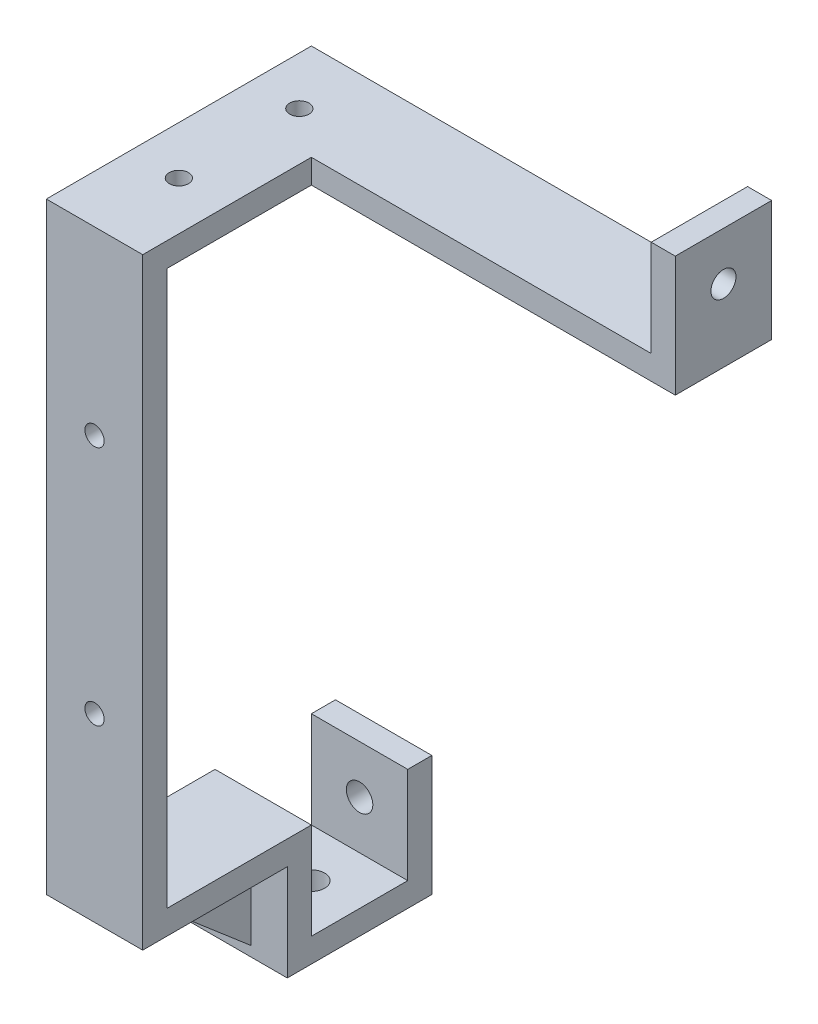
ISO-10303-21;
HEADER;
FILE_DESCRIPTION(('STEP AP214'),'2;1');
FILE_NAME('part.step','',(''),(''),'','','');
FILE_SCHEMA(('AUTOMOTIVE_DESIGN { 1 0 10303 214 1 1 1 1 }'));
ENDSEC;
DATA;
#1=APPLICATION_CONTEXT('core data for automotive mechanical design processes');
#2=APPLICATION_PROTOCOL_DEFINITION('international standard','automotive_design',2000,#1);
#3=PRODUCT_CONTEXT('',#1,'mechanical');
#4=PRODUCT('Part','Part','',(#3));
#5=PRODUCT_RELATED_PRODUCT_CATEGORY('part','',(#4));
#6=PRODUCT_DEFINITION_FORMATION('','',#4);
#7=PRODUCT_DEFINITION_CONTEXT('part definition',#1,'design');
#8=PRODUCT_DEFINITION('design','',#6,#7);
#9=PRODUCT_DEFINITION_SHAPE('','',#8);
#10=(LENGTH_UNIT() NAMED_UNIT(*) SI_UNIT(.MILLI.,.METRE.));
#11=(NAMED_UNIT(*) PLANE_ANGLE_UNIT() SI_UNIT($,.RADIAN.));
#12=(NAMED_UNIT(*) SI_UNIT($,.STERADIAN.) SOLID_ANGLE_UNIT());
#13=UNCERTAINTY_MEASURE_WITH_UNIT(LENGTH_MEASURE(1.E-05),#10,'distance_accuracy_value','');
#14=(GEOMETRIC_REPRESENTATION_CONTEXT(3) GLOBAL_UNCERTAINTY_ASSIGNED_CONTEXT((#13)) GLOBAL_UNIT_ASSIGNED_CONTEXT((#10,
#11,#12)) REPRESENTATION_CONTEXT('',''));
#15=CARTESIAN_POINT('',(0.,0.,0.));
#16=DIRECTION('',(0.,0.,1.));
#17=DIRECTION('',(1.,0.,0.));
#18=AXIS2_PLACEMENT_3D('',#15,#16,#17);
#19=CARTESIAN_POINT('',(-9.82905982905984,-125.128205128205,-55.));
#20=DIRECTION('',(0.,-1.,0.));
#21=DIRECTION('',(0.,0.,-1.));
#22=AXIS2_PLACEMENT_3D('',#19,#20,#21);
#23=PLANE('',#22);
#24=CARTESIAN_POINT('',(0.170940170940168,-125.128205128205,-45.));
#25=DIRECTION('',(0.,1.,0.));
#26=DIRECTION('',(0.,0.,1.));
#27=AXIS2_PLACEMENT_3D('',#24,#25,#26);
#28=CIRCLE('',#27,2.75);
#29=CARTESIAN_POINT('',(0.170940170940168,-125.128205128205,-42.25));
#30=VERTEX_POINT('',#29);
#31=EDGE_CURVE('E277',#30,#30,#28,.T.);
#32=ORIENTED_EDGE('',*,*,#31,.F.);
#33=EDGE_LOOP('',(#32));
#34=FACE_BOUND('',#33,.T.);
#35=DIRECTION('',(1.,0.,0.));
#36=VECTOR('',#35,1.);
#37=CARTESIAN_POINT('',(10.1709401709402,-125.128205128205,-55.));
#38=LINE('',#37,#36);
#39=CARTESIAN_POINT('',(-9.82905982905984,-125.128205128205,-55.));
#40=VERTEX_POINT('',#39);
#41=CARTESIAN_POINT('',(10.1709401709402,-125.128205128205,-55.));
#42=VERTEX_POINT('',#41);
#43=EDGE_CURVE('E242',#40,#42,#38,.T.);
#44=ORIENTED_EDGE('',*,*,#43,.F.);
#45=DIRECTION('',(0.,0.,1.));
#46=VECTOR('',#45,1.);
#47=CARTESIAN_POINT('',(-9.82905982905984,-125.128205128205,-55.));
#48=LINE('',#47,#46);
#49=CARTESIAN_POINT('',(-9.82905982905984,-125.128205128205,-35.));
#50=VERTEX_POINT('',#49);
#51=EDGE_CURVE('E342',#40,#50,#48,.T.);
#52=ORIENTED_EDGE('',*,*,#51,.T.);
#53=DIRECTION('',(1.,0.,0.));
#54=VECTOR('',#53,1.);
#55=CARTESIAN_POINT('',(-9.82905982905984,-125.128205128205,-35.));
#56=LINE('',#55,#54);
#57=CARTESIAN_POINT('',(10.1709401709402,-125.128205128205,-35.));
#58=VERTEX_POINT('',#57);
#59=EDGE_CURVE('E335',#50,#58,#56,.T.);
#60=ORIENTED_EDGE('',*,*,#59,.T.);
#61=DIRECTION('',(0.,0.,1.));
#62=VECTOR('',#61,1.);
#63=CARTESIAN_POINT('',(10.1709401709402,-125.128205128205,-55.));
#64=LINE('',#63,#62);
#65=EDGE_CURVE('E339',#42,#58,#64,.T.);
#66=ORIENTED_EDGE('',*,*,#65,.F.);
#67=EDGE_LOOP('',(#44,#52,#60,#66));
#68=FACE_BOUND('',#67,.T.);
#69=ADVANCED_FACE('F39',(#34,#68),#23,.F.);
#70=CARTESIAN_POINT('',(10.1709401709402,-110.128205128205,-35.));
#71=DIRECTION('',(0.,1.,0.));
#72=DIRECTION('',(0.,0.,1.));
#73=AXIS2_PLACEMENT_3D('',#70,#71,#72);
#74=PLANE('',#73);
#75=DIRECTION('',(-1.,0.,0.));
#76=VECTOR('',#75,1.);
#77=CARTESIAN_POINT('',(10.1709401709402,-110.128205128205,-30.));
#78=LINE('',#77,#76);
#79=CARTESIAN_POINT('',(10.1709401709402,-110.128205128205,-30.));
#80=VERTEX_POINT('',#79);
#81=CARTESIAN_POINT('',(-9.82905982905984,-110.128205128205,-30.));
#82=VERTEX_POINT('',#81);
#83=EDGE_CURVE('E345',#80,#82,#78,.T.);
#84=ORIENTED_EDGE('',*,*,#83,.F.);
#85=DIRECTION('',(0.,0.,1.));
#86=VECTOR('',#85,1.);
#87=CARTESIAN_POINT('',(10.1709401709402,-110.128205128205,-35.));
#88=LINE('',#87,#86);
#89=CARTESIAN_POINT('',(10.1709401709402,-110.128205128205,0.));
#90=VERTEX_POINT('',#89);
#91=EDGE_CURVE('E390',#80,#90,#88,.T.);
#92=ORIENTED_EDGE('',*,*,#91,.T.);
#93=DIRECTION('',(-1.,0.,0.));
#94=VECTOR('',#93,1.);
#95=CARTESIAN_POINT('',(0.,-110.128205128205,0.));
#96=LINE('',#95,#94);
#97=CARTESIAN_POINT('',(-9.82905982905984,-110.128205128205,0.));
#98=VERTEX_POINT('',#97);
#99=EDGE_CURVE('E436',#90,#98,#96,.T.);
#100=ORIENTED_EDGE('',*,*,#99,.T.);
#101=DIRECTION('',(0.,0.,1.));
#102=VECTOR('',#101,1.);
#103=CARTESIAN_POINT('',(-9.82905982905984,-110.128205128205,-35.));
#104=LINE('',#103,#102);
#105=EDGE_CURVE('E387',#82,#98,#104,.T.);
#106=ORIENTED_EDGE('',*,*,#105,.F.);
#107=EDGE_LOOP('',(#84,#92,#100,#106));
#108=FACE_BOUND('',#107,.T.);
#109=DIRECTION('',(0.,0.,1.));
#110=VECTOR('',#109,1.);
#111=CARTESIAN_POINT('',(2.67094017094017,-110.128205128205,-35.));
#112=LINE('',#111,#110);
#113=CARTESIAN_POINT('',(2.67094017094017,-110.128205128205,-29.9291696383079));
#114=VERTEX_POINT('',#113);
#115=CARTESIAN_POINT('',(2.67094017094017,-110.128205128205,-9.07177753676453));
#116=VERTEX_POINT('',#115);
#117=EDGE_CURVE('E11',#114,#116,#112,.T.);
#118=ORIENTED_EDGE('',*,*,#117,.F.);
#119=DIRECTION('',(1.,0.,0.));
#120=VECTOR('',#119,1.);
#121=CARTESIAN_POINT('',(10.1709401709402,-110.128205128205,-29.9291696383079));
#122=LINE('',#121,#120);
#123=CARTESIAN_POINT('',(-2.32905982905983,-110.128205128205,-29.9291696383079));
#124=VERTEX_POINT('',#123);
#125=EDGE_CURVE('E446',#124,#114,#122,.T.);
#126=ORIENTED_EDGE('',*,*,#125,.F.);
#127=DIRECTION('',(0.,0.,1.));
#128=VECTOR('',#127,1.);
#129=CARTESIAN_POINT('',(-2.32905982905983,-110.128205128205,-35.));
#130=LINE('',#129,#128);
#131=CARTESIAN_POINT('',(-2.32905982905983,-110.128205128205,-9.07177753676453));
#132=VERTEX_POINT('',#131);
#133=EDGE_CURVE('E442',#124,#132,#130,.T.);
#134=ORIENTED_EDGE('',*,*,#133,.T.);
#135=DIRECTION('',(-1.,0.,0.));
#136=VECTOR('',#135,1.);
#137=CARTESIAN_POINT('',(10.1709401709402,-110.128205128205,-9.07177753676454));
#138=LINE('',#137,#136);
#139=EDGE_CURVE('E48',#116,#132,#138,.T.);
#140=ORIENTED_EDGE('',*,*,#139,.F.);
#141=EDGE_LOOP('',(#118,#126,#134,#140));
#142=FACE_BOUND('',#141,.T.);
#143=ADVANCED_FACE('F458',(#108,#142),#74,.F.);
#144=CARTESIAN_POINT('',(0.,0.,-35.));
#145=DIRECTION('',(0.,0.,-1.));
#146=DIRECTION('',(-1.,0.,0.));
#147=AXIS2_PLACEMENT_3D('',#144,#145,#146);
#148=PLANE('',#147);
#149=DIRECTION('',(0.,-1.,0.));
#150=VECTOR('',#149,1.);
#151=CARTESIAN_POINT('',(10.1709401709402,-105.128205128205,-35.));
#152=LINE('',#151,#150);
#153=CARTESIAN_POINT('',(10.1709401709402,-105.128205128205,-35.));
#154=VERTEX_POINT('',#153);
#155=EDGE_CURVE('E368',#154,#58,#152,.T.);
#156=ORIENTED_EDGE('',*,*,#155,.T.);
#157=ORIENTED_EDGE('',*,*,#59,.F.);
#158=DIRECTION('',(0.,1.,0.));
#159=VECTOR('',#158,1.);
#160=CARTESIAN_POINT('',(-9.82905982905984,-110.128205128205,-35.));
#161=LINE('',#160,#159);
#162=CARTESIAN_POINT('',(-9.82905982905984,-105.128205128205,-35.));
#163=VERTEX_POINT('',#162);
#164=EDGE_CURVE('E372',#50,#163,#161,.T.);
#165=ORIENTED_EDGE('',*,*,#164,.T.);
#166=DIRECTION('',(1.,0.,0.));
#167=VECTOR('',#166,1.);
#168=CARTESIAN_POINT('',(10.1709401709402,-105.128205128205,-35.));
#169=LINE('',#168,#167);
#170=EDGE_CURVE('E375',#163,#154,#169,.T.);
#171=ORIENTED_EDGE('',*,*,#170,.T.);
#172=EDGE_LOOP('',(#156,#157,#165,#171));
#173=FACE_BOUND('',#172,.T.);
#174=ADVANCED_FACE('F483',(#173),#148,.T.);
#175=CARTESIAN_POINT('',(0.,0.,-5.));
#176=DIRECTION('',(0.,0.,1.));
#177=DIRECTION('',(1.,0.,0.));
#178=AXIS2_PLACEMENT_3D('',#175,#176,#177);
#179=PLANE('',#178);
#180=CARTESIAN_POINT('',(0.170940170940166,-22.6282051282051,-5.));
#181=DIRECTION('',(0.,0.,-1.));
#182=DIRECTION('',(-1.,0.,0.));
#183=AXIS2_PLACEMENT_3D('',#180,#181,#182);
#184=CIRCLE('',#183,2.);
#185=CARTESIAN_POINT('',(-1.82905982905983,-22.6282051282051,-5.));
#186=VERTEX_POINT('',#185);
#187=EDGE_CURVE('E291',#186,#186,#184,.T.);
#188=ORIENTED_EDGE('',*,*,#187,.F.);
#189=EDGE_LOOP('',(#188));
#190=FACE_BOUND('',#189,.T.);
#191=CARTESIAN_POINT('',(0.170940170940166,-72.6282051282051,-5.));
#192=DIRECTION('',(0.,0.,-1.));
#193=DIRECTION('',(-1.,0.,0.));
#194=AXIS2_PLACEMENT_3D('',#191,#192,#193);
#195=CIRCLE('',#194,2.);
#196=CARTESIAN_POINT('',(-1.82905982905983,-72.6282051282051,-5.));
#197=VERTEX_POINT('',#196);
#198=EDGE_CURVE('E282',#197,#197,#195,.T.);
#199=ORIENTED_EDGE('',*,*,#198,.F.);
#200=EDGE_LOOP('',(#199));
#201=FACE_BOUND('',#200,.T.);
#202=DIRECTION('',(1.,0.,0.));
#203=VECTOR('',#202,1.);
#204=CARTESIAN_POINT('',(10.1709401709402,-105.128205128205,-5.));
#205=LINE('',#204,#203);
#206=CARTESIAN_POINT('',(-9.82905982905984,-105.128205128205,-5.));
#207=VERTEX_POINT('',#206);
#208=CARTESIAN_POINT('',(10.1709401709402,-105.128205128205,-5.));
#209=VERTEX_POINT('',#208);
#210=EDGE_CURVE('E367',#207,#209,#205,.T.);
#211=ORIENTED_EDGE('',*,*,#210,.F.);
#212=DIRECTION('',(0.,-1.,0.));
#213=VECTOR('',#212,1.);
#214=CARTESIAN_POINT('',(-9.82905982905984,14.8717948717949,-5.));
#215=LINE('',#214,#213);
#216=CARTESIAN_POINT('',(-9.82905982905984,9.87179487179487,-5.));
#217=VERTEX_POINT('',#216);
#218=EDGE_CURVE('E413',#217,#207,#215,.T.);
#219=ORIENTED_EDGE('',*,*,#218,.F.);
#220=DIRECTION('',(-1.,0.,0.));
#221=VECTOR('',#220,1.);
#222=CARTESIAN_POINT('',(10.1709401709402,9.87179487179488,-5.));
#223=LINE('',#222,#221);
#224=CARTESIAN_POINT('',(10.1709401709402,9.87179487179487,-5.));
#225=VERTEX_POINT('',#224);
#226=EDGE_CURVE('E393',#225,#217,#223,.T.);
#227=ORIENTED_EDGE('',*,*,#226,.F.);
#228=DIRECTION('',(0.,1.,0.));
#229=VECTOR('',#228,1.);
#230=CARTESIAN_POINT('',(10.1709401709402,14.8717948717949,-5.));
#231=LINE('',#230,#229);
#232=EDGE_CURVE('E417',#209,#225,#231,.T.);
#233=ORIENTED_EDGE('',*,*,#232,.F.);
#234=EDGE_LOOP('',(#211,#219,#227,#233));
#235=FACE_BOUND('',#234,.T.);
#236=ADVANCED_FACE('F501',(#190,#201,#235),#179,.F.);
#237=CARTESIAN_POINT('',(-9.82905982905984,14.8717948717949,-5.));
#238=DIRECTION('',(-1.,0.,0.));
#239=DIRECTION('',(0.,-1.,0.));
#240=AXIS2_PLACEMENT_3D('',#237,#238,#239);
#241=PLANE('',#240);
#242=ORIENTED_EDGE('',*,*,#164,.F.);
#243=ORIENTED_EDGE('',*,*,#51,.F.);
#244=DIRECTION('',(0.,-1.,0.));
#245=VECTOR('',#244,1.);
#246=CARTESIAN_POINT('',(-9.82905982905984,-105.128205128205,-55.));
#247=LINE('',#246,#245);
#248=CARTESIAN_POINT('',(-9.82905982905984,-105.128205128205,-55.));
#249=VERTEX_POINT('',#248);
#250=EDGE_CURVE('E263',#249,#40,#247,.T.);
#251=ORIENTED_EDGE('',*,*,#250,.F.);
#252=DIRECTION('',(0.,0.,1.));
#253=VECTOR('',#252,1.);
#254=CARTESIAN_POINT('',(-9.82905982905984,-105.128205128205,-60.));
#255=LINE('',#254,#253);
#256=CARTESIAN_POINT('',(-9.82905982905984,-105.128205128205,-60.));
#257=VERTEX_POINT('',#256);
#258=EDGE_CURVE('E251',#257,#249,#255,.T.);
#259=ORIENTED_EDGE('',*,*,#258,.F.);
#260=DIRECTION('',(0.,1.,0.));
#261=VECTOR('',#260,1.);
#262=CARTESIAN_POINT('',(-9.82905982905984,-130.128205128205,-60.));
#263=LINE('',#262,#261);
#264=CARTESIAN_POINT('',(-9.82905982905984,-130.128205128205,-60.));
#265=VERTEX_POINT('',#264);
#266=EDGE_CURVE('E270',#265,#257,#263,.T.);
#267=ORIENTED_EDGE('',*,*,#266,.F.);
#268=DIRECTION('',(0.,0.,-1.));
#269=VECTOR('',#268,1.);
#270=CARTESIAN_POINT('',(-9.82905982905984,-130.128205128205,-35.));
#271=LINE('',#270,#269);
#272=CARTESIAN_POINT('',(-9.82905982905984,-130.128205128205,-30.));
#273=VERTEX_POINT('',#272);
#274=EDGE_CURVE('E353',#273,#265,#271,.T.);
#275=ORIENTED_EDGE('',*,*,#274,.F.);
#276=DIRECTION('',(0.,1.,0.));
#277=VECTOR('',#276,1.);
#278=CARTESIAN_POINT('',(-9.82905982905984,-130.128205128205,-30.));
#279=LINE('',#278,#277);
#280=EDGE_CURVE('E356',#273,#82,#279,.T.);
#281=ORIENTED_EDGE('',*,*,#280,.T.);
#282=ORIENTED_EDGE('',*,*,#105,.T.);
#283=DIRECTION('',(0.,-1.,0.));
#284=VECTOR('',#283,1.);
#285=CARTESIAN_POINT('',(-9.82905982905984,14.8717948717949,0.));
#286=LINE('',#285,#284);
#287=CARTESIAN_POINT('',(-9.82905982905984,14.8717948717949,0.));
#288=VERTEX_POINT('',#287);
#289=EDGE_CURVE('E412',#288,#98,#286,.T.);
#290=ORIENTED_EDGE('',*,*,#289,.F.);
#291=DIRECTION('',(0.,0.,1.));
#292=VECTOR('',#291,1.);
#293=CARTESIAN_POINT('',(-9.82905982905984,14.8717948717949,-5.));
#294=LINE('',#293,#292);
#295=CARTESIAN_POINT('',(-9.82905982905984,14.8717948717949,-55.));
#296=VERTEX_POINT('',#295);
#297=EDGE_CURVE('E433',#296,#288,#294,.T.);
#298=ORIENTED_EDGE('',*,*,#297,.F.);
#299=DIRECTION('',(0.,1.,0.));
#300=VECTOR('',#299,1.);
#301=CARTESIAN_POINT('',(-9.82905982905984,14.8717948717949,-55.));
#302=LINE('',#301,#300);
#303=CARTESIAN_POINT('',(-9.82905982905984,9.87179487179487,-55.));
#304=VERTEX_POINT('',#303);
#305=EDGE_CURVE('E397',#304,#296,#302,.T.);
#306=ORIENTED_EDGE('',*,*,#305,.F.);
#307=DIRECTION('',(0.,0.,1.));
#308=VECTOR('',#307,1.);
#309=CARTESIAN_POINT('',(-9.82905982905984,9.87179487179487,-55.));
#310=LINE('',#309,#308);
#311=EDGE_CURVE('E402',#304,#217,#310,.T.);
#312=ORIENTED_EDGE('',*,*,#311,.T.);
#313=ORIENTED_EDGE('',*,*,#218,.T.);
#314=DIRECTION('',(0.,0.,1.));
#315=VECTOR('',#314,1.);
#316=CARTESIAN_POINT('',(-9.82905982905984,-105.128205128205,-35.));
#317=LINE('',#316,#315);
#318=EDGE_CURVE('E384',#163,#207,#317,.T.);
#319=ORIENTED_EDGE('',*,*,#318,.F.);
#320=EDGE_LOOP('',(#242,#243,#251,#259,#267,#275,#281,#282,#290,#298,#306,#312,#313,#319));
#321=FACE_BOUND('',#320,.T.);
#322=ADVANCED_FACE('F41',(#321),#241,.T.);
#323=CARTESIAN_POINT('',(-9.82905982905984,14.8717948717949,-5.));
#324=DIRECTION('',(0.,1.,0.));
#325=DIRECTION('',(0.,0.,1.));
#326=AXIS2_PLACEMENT_3D('',#323,#324,#325);
#327=PLANE('',#326);
#328=DIRECTION('',(0.,0.,1.));
#329=VECTOR('',#328,1.);
#330=CARTESIAN_POINT('',(80.6909401709401,14.8717948717949,-55.));
#331=LINE('',#330,#329);
#332=CARTESIAN_POINT('',(80.6909401709401,14.8717948717949,-55.));
#333=VERTEX_POINT('',#332);
#334=CARTESIAN_POINT('',(80.6909401709401,14.8717948717949,-35.));
#335=VERTEX_POINT('',#334);
#336=EDGE_CURVE('E55',#333,#335,#331,.T.);
#337=ORIENTED_EDGE('',*,*,#336,.F.);
#338=DIRECTION('',(1.,0.,0.));
#339=VECTOR('',#338,1.);
#340=CARTESIAN_POINT('',(10.1709401709402,14.8717948717949,-55.));
#341=LINE('',#340,#339);
#342=EDGE_CURVE('E208',#296,#333,#341,.T.);
#343=ORIENTED_EDGE('',*,*,#342,.F.);
#344=ORIENTED_EDGE('',*,*,#297,.T.);
#345=DIRECTION('',(-1.,0.,0.));
#346=VECTOR('',#345,1.);
#347=CARTESIAN_POINT('',(-9.82905982905984,14.8717948717949,0.));
#348=LINE('',#347,#346);
#349=CARTESIAN_POINT('',(10.1709401709402,14.8717948717949,0.));
#350=VERTEX_POINT('',#349);
#351=EDGE_CURVE('E418',#350,#288,#348,.T.);
#352=ORIENTED_EDGE('',*,*,#351,.F.);
#353=DIRECTION('',(0.,0.,1.));
#354=VECTOR('',#353,1.);
#355=CARTESIAN_POINT('',(10.1709401709402,14.8717948717949,-5.));
#356=LINE('',#355,#354);
#357=CARTESIAN_POINT('',(10.1709401709402,14.8717948717949,-35.));
#358=VERTEX_POINT('',#357);
#359=EDGE_CURVE('E422',#358,#350,#356,.T.);
#360=ORIENTED_EDGE('',*,*,#359,.F.);
#361=DIRECTION('',(-1.,0.,0.));
#362=VECTOR('',#361,1.);
#363=CARTESIAN_POINT('',(85.6909401709401,14.8717948717949,-35.));
#364=LINE('',#363,#362);
#365=EDGE_CURVE('E62',#335,#358,#364,.T.);
#366=ORIENTED_EDGE('',*,*,#365,.F.);
#367=EDGE_LOOP('',(#337,#343,#344,#352,#360,#366));
#368=FACE_BOUND('',#367,.T.);
#369=CARTESIAN_POINT('',(0.170940170940157,14.8717948717949,-17.5));
#370=DIRECTION('',(0.,-1.,0.));
#371=DIRECTION('',(1.,0.,0.));
#372=AXIS2_PLACEMENT_3D('',#369,#370,#371);
#373=CIRCLE('',#372,2.);
#374=CARTESIAN_POINT('',(2.17094017094016,14.8717948717949,-17.5));
#375=VERTEX_POINT('',#374);
#376=EDGE_CURVE('E302',#375,#375,#373,.T.);
#377=ORIENTED_EDGE('',*,*,#376,.T.);
#378=EDGE_LOOP('',(#377));
#379=FACE_BOUND('',#378,.T.);
#380=CARTESIAN_POINT('',(0.170940170940164,14.8717948717949,-42.5));
#381=DIRECTION('',(0.,-1.,0.));
#382=DIRECTION('',(1.,0.,0.));
#383=AXIS2_PLACEMENT_3D('',#380,#381,#382);
#384=CIRCLE('',#383,2.);
#385=CARTESIAN_POINT('',(2.17094017094016,14.8717948717949,-42.5));
#386=VERTEX_POINT('',#385);
#387=EDGE_CURVE('E311',#386,#386,#384,.T.);
#388=ORIENTED_EDGE('',*,*,#387,.T.);
#389=EDGE_LOOP('',(#388));
#390=FACE_BOUND('',#389,.T.);
#391=ADVANCED_FACE('F520',(#368,#379,#390),#327,.T.);
#392=CARTESIAN_POINT('',(10.1709401709402,14.8717948717949,-5.));
#393=DIRECTION('',(1.,0.,0.));
#394=DIRECTION('',(0.,1.,0.));
#395=AXIS2_PLACEMENT_3D('',#392,#393,#394);
#396=PLANE('',#395);
#397=DIRECTION('',(0.,-1.,0.));
#398=VECTOR('',#397,1.);
#399=CARTESIAN_POINT('',(10.1709401709402,14.8717948717949,-35.));
#400=LINE('',#399,#398);
#401=CARTESIAN_POINT('',(10.1709401709402,9.87179487179488,-35.));
#402=VERTEX_POINT('',#401);
#403=EDGE_CURVE('E210',#358,#402,#400,.T.);
#404=ORIENTED_EDGE('',*,*,#403,.F.);
#405=ORIENTED_EDGE('',*,*,#359,.T.);
#406=DIRECTION('',(0.,1.,0.));
#407=VECTOR('',#406,1.);
#408=CARTESIAN_POINT('',(10.1709401709402,14.8717948717949,0.));
#409=LINE('',#408,#407);
#410=EDGE_CURVE('E426',#90,#350,#409,.T.);
#411=ORIENTED_EDGE('',*,*,#410,.F.);
#412=ORIENTED_EDGE('',*,*,#91,.F.);
#413=DIRECTION('',(0.,1.,0.));
#414=VECTOR('',#413,1.);
#415=CARTESIAN_POINT('',(10.1709401709402,-130.128205128205,-30.));
#416=LINE('',#415,#414);
#417=CARTESIAN_POINT('',(10.1709401709402,-130.128205128205,-30.));
#418=VERTEX_POINT('',#417);
#419=EDGE_CURVE('E363',#418,#80,#416,.T.);
#420=ORIENTED_EDGE('',*,*,#419,.F.);
#421=DIRECTION('',(0.,0.,1.));
#422=VECTOR('',#421,1.);
#423=CARTESIAN_POINT('',(10.1709401709402,-130.128205128205,-30.));
#424=LINE('',#423,#422);
#425=CARTESIAN_POINT('',(10.1709401709402,-130.128205128205,-60.));
#426=VERTEX_POINT('',#425);
#427=EDGE_CURVE('E346',#426,#418,#424,.T.);
#428=ORIENTED_EDGE('',*,*,#427,.F.);
#429=DIRECTION('',(0.,-1.,0.));
#430=VECTOR('',#429,1.);
#431=CARTESIAN_POINT('',(10.1709401709402,-125.128205128205,-60.));
#432=LINE('',#431,#430);
#433=CARTESIAN_POINT('',(10.1709401709402,-105.128205128205,-60.));
#434=VERTEX_POINT('',#433);
#435=EDGE_CURVE('E273',#434,#426,#432,.T.);
#436=ORIENTED_EDGE('',*,*,#435,.F.);
#437=DIRECTION('',(0.,0.,-1.));
#438=VECTOR('',#437,1.);
#439=CARTESIAN_POINT('',(10.1709401709402,-105.128205128205,-55.));
#440=LINE('',#439,#438);
#441=CARTESIAN_POINT('',(10.1709401709402,-105.128205128205,-55.));
#442=VERTEX_POINT('',#441);
#443=EDGE_CURVE('E243',#442,#434,#440,.T.);
#444=ORIENTED_EDGE('',*,*,#443,.F.);
#445=DIRECTION('',(0.,-1.,0.));
#446=VECTOR('',#445,1.);
#447=CARTESIAN_POINT('',(10.1709401709402,-105.128205128205,-55.));
#448=LINE('',#447,#446);
#449=EDGE_CURVE('E257',#442,#42,#448,.T.);
#450=ORIENTED_EDGE('',*,*,#449,.T.);
#451=ORIENTED_EDGE('',*,*,#65,.T.);
#452=ORIENTED_EDGE('',*,*,#155,.F.);
#453=DIRECTION('',(0.,0.,1.));
#454=VECTOR('',#453,1.);
#455=CARTESIAN_POINT('',(10.1709401709402,-105.128205128205,-35.));
#456=LINE('',#455,#454);
#457=EDGE_CURVE('E378',#154,#209,#456,.T.);
#458=ORIENTED_EDGE('',*,*,#457,.T.);
#459=ORIENTED_EDGE('',*,*,#232,.T.);
#460=DIRECTION('',(0.,0.,1.));
#461=VECTOR('',#460,1.);
#462=CARTESIAN_POINT('',(10.1709401709402,9.87179487179488,-55.));
#463=LINE('',#462,#461);
#464=EDGE_CURVE('E409',#402,#225,#463,.T.);
#465=ORIENTED_EDGE('',*,*,#464,.F.);
#466=EDGE_LOOP('',(#404,#405,#411,#412,#420,#428,#436,#444,#450,#451,#452,#458,#459,#465));
#467=FACE_BOUND('',#466,.T.);
#468=ADVANCED_FACE('F518',(#467),#396,.T.);
#469=CARTESIAN_POINT('',(0.,0.,0.));
#470=DIRECTION('',(0.,0.,1.));
#471=DIRECTION('',(1.,0.,0.));
#472=AXIS2_PLACEMENT_3D('',#469,#470,#471);
#473=PLANE('',#472);
#474=CARTESIAN_POINT('',(0.170940170940166,-22.6282051282051,0.));
#475=DIRECTION('',(0.,0.,-1.));
#476=DIRECTION('',(-1.,0.,0.));
#477=AXIS2_PLACEMENT_3D('',#474,#475,#476);
#478=CIRCLE('',#477,2.);
#479=CARTESIAN_POINT('',(-1.82905982905983,-22.6282051282051,0.));
#480=VERTEX_POINT('',#479);
#481=EDGE_CURVE('E286',#480,#480,#478,.T.);
#482=ORIENTED_EDGE('',*,*,#481,.T.);
#483=EDGE_LOOP('',(#482));
#484=FACE_BOUND('',#483,.T.);
#485=CARTESIAN_POINT('',(0.170940170940166,-72.6282051282051,0.));
#486=DIRECTION('',(0.,0.,-1.));
#487=DIRECTION('',(-1.,0.,0.));
#488=AXIS2_PLACEMENT_3D('',#485,#486,#487);
#489=CIRCLE('',#488,2.);
#490=CARTESIAN_POINT('',(-1.82905982905983,-72.6282051282051,0.));
#491=VERTEX_POINT('',#490);
#492=EDGE_CURVE('E295',#491,#491,#489,.T.);
#493=ORIENTED_EDGE('',*,*,#492,.T.);
#494=EDGE_LOOP('',(#493));
#495=FACE_BOUND('',#494,.T.);
#496=ORIENTED_EDGE('',*,*,#99,.F.);
#497=ORIENTED_EDGE('',*,*,#410,.T.);
#498=ORIENTED_EDGE('',*,*,#351,.T.);
#499=ORIENTED_EDGE('',*,*,#289,.T.);
#500=EDGE_LOOP('',(#496,#497,#498,#499));
#501=FACE_BOUND('',#500,.T.);
#502=ADVANCED_FACE('F511',(#484,#495,#501),#473,.T.);
#503=CARTESIAN_POINT('',(10.1709401709402,9.87179487179488,-55.));
#504=DIRECTION('',(0.,1.,0.));
#505=DIRECTION('',(-1.,0.,0.));
#506=AXIS2_PLACEMENT_3D('',#503,#504,#505);
#507=PLANE('',#506);
#508=CARTESIAN_POINT('',(0.170940170940159,9.87179487179487,-17.5));
#509=DIRECTION('',(0.,-1.,0.));
#510=DIRECTION('',(1.,0.,0.));
#511=AXIS2_PLACEMENT_3D('',#508,#509,#510);
#512=CIRCLE('',#511,2.);
#513=CARTESIAN_POINT('',(2.17094017094016,9.87179487179487,-17.5));
#514=VERTEX_POINT('',#513);
#515=EDGE_CURVE('E307',#514,#514,#512,.T.);
#516=ORIENTED_EDGE('',*,*,#515,.F.);
#517=EDGE_LOOP('',(#516));
#518=FACE_BOUND('',#517,.T.);
#519=CARTESIAN_POINT('',(0.170940170940166,9.87179487179487,-42.5));
#520=DIRECTION('',(0.,-1.,0.));
#521=DIRECTION('',(1.,0.,0.));
#522=AXIS2_PLACEMENT_3D('',#519,#520,#521);
#523=CIRCLE('',#522,2.);
#524=CARTESIAN_POINT('',(2.17094017094017,9.87179487179487,-42.5));
#525=VERTEX_POINT('',#524);
#526=EDGE_CURVE('E290',#525,#525,#523,.T.);
#527=ORIENTED_EDGE('',*,*,#526,.F.);
#528=EDGE_LOOP('',(#527));
#529=FACE_BOUND('',#528,.T.);
#530=ORIENTED_EDGE('',*,*,#226,.T.);
#531=ORIENTED_EDGE('',*,*,#311,.F.);
#532=DIRECTION('',(-1.,0.,0.));
#533=VECTOR('',#532,1.);
#534=CARTESIAN_POINT('',(10.1709401709402,9.87179487179488,-55.));
#535=LINE('',#534,#533);
#536=CARTESIAN_POINT('',(85.6909401709401,9.87179487179488,-55.));
#537=VERTEX_POINT('',#536);
#538=EDGE_CURVE('E394',#537,#304,#535,.T.);
#539=ORIENTED_EDGE('',*,*,#538,.F.);
#540=DIRECTION('',(0.,0.,-1.));
#541=VECTOR('',#540,1.);
#542=CARTESIAN_POINT('',(85.6909401709401,9.87179487179488,-55.));
#543=LINE('',#542,#541);
#544=CARTESIAN_POINT('',(85.6909401709401,9.87179487179488,-35.));
#545=VERTEX_POINT('',#544);
#546=EDGE_CURVE('E221',#545,#537,#543,.T.);
#547=ORIENTED_EDGE('',*,*,#546,.F.);
#548=DIRECTION('',(-1.,0.,0.));
#549=VECTOR('',#548,1.);
#550=CARTESIAN_POINT('',(85.6909401709401,9.87179487179488,-35.));
#551=LINE('',#550,#549);
#552=EDGE_CURVE('E227',#545,#402,#551,.T.);
#553=ORIENTED_EDGE('',*,*,#552,.T.);
#554=ORIENTED_EDGE('',*,*,#464,.T.);
#555=EDGE_LOOP('',(#530,#531,#539,#547,#553,#554));
#556=FACE_BOUND('',#555,.T.);
#557=ADVANCED_FACE('F508',(#518,#529,#556),#507,.F.);
#558=CARTESIAN_POINT('',(0.,0.,-55.));
#559=DIRECTION('',(0.,0.,1.));
#560=DIRECTION('',(1.,0.,0.));
#561=AXIS2_PLACEMENT_3D('',#558,#559,#560);
#562=PLANE('',#561);
#563=ORIENTED_EDGE('',*,*,#342,.T.);
#564=DIRECTION('',(0.,-1.,0.));
#565=VECTOR('',#564,1.);
#566=CARTESIAN_POINT('',(80.6909401709401,34.8717948717949,-55.));
#567=LINE('',#566,#565);
#568=CARTESIAN_POINT('',(80.6909401709401,34.8717948717949,-55.));
#569=VERTEX_POINT('',#568);
#570=EDGE_CURVE('E188',#569,#333,#567,.T.);
#571=ORIENTED_EDGE('',*,*,#570,.F.);
#572=DIRECTION('',(-1.,0.,0.));
#573=VECTOR('',#572,1.);
#574=CARTESIAN_POINT('',(80.6909401709401,34.8717948717949,-55.));
#575=LINE('',#574,#573);
#576=CARTESIAN_POINT('',(85.6909401709401,34.8717948717949,-55.));
#577=VERTEX_POINT('',#576);
#578=EDGE_CURVE('E195',#577,#569,#575,.T.);
#579=ORIENTED_EDGE('',*,*,#578,.F.);
#580=DIRECTION('',(0.,1.,0.));
#581=VECTOR('',#580,1.);
#582=CARTESIAN_POINT('',(85.6909401709401,14.8717948717949,-55.));
#583=LINE('',#582,#581);
#584=EDGE_CURVE('E225',#537,#577,#583,.T.);
#585=ORIENTED_EDGE('',*,*,#584,.F.);
#586=ORIENTED_EDGE('',*,*,#538,.T.);
#587=ORIENTED_EDGE('',*,*,#305,.T.);
#588=EDGE_LOOP('',(#563,#571,#579,#585,#586,#587));
#589=FACE_BOUND('',#588,.T.);
#590=ADVANCED_FACE('F206',(#589),#562,.F.);
#591=CARTESIAN_POINT('',(10.1709401709402,-105.128205128205,-35.));
#592=DIRECTION('',(0.,-1.,0.));
#593=DIRECTION('',(0.,0.,-1.));
#594=AXIS2_PLACEMENT_3D('',#591,#592,#593);
#595=PLANE('',#594);
#596=ORIENTED_EDGE('',*,*,#210,.T.);
#597=ORIENTED_EDGE('',*,*,#457,.F.);
#598=ORIENTED_EDGE('',*,*,#170,.F.);
#599=ORIENTED_EDGE('',*,*,#318,.T.);
#600=EDGE_LOOP('',(#596,#597,#598,#599));
#601=FACE_BOUND('',#600,.T.);
#602=ADVANCED_FACE('F497',(#601),#595,.F.);
#603=CARTESIAN_POINT('',(10.1709401709402,-130.128205128205,-30.));
#604=DIRECTION('',(0.,0.,-1.));
#605=DIRECTION('',(-1.,0.,0.));
#606=AXIS2_PLACEMENT_3D('',#603,#604,#605);
#607=PLANE('',#606);
#608=ORIENTED_EDGE('',*,*,#83,.T.);
#609=ORIENTED_EDGE('',*,*,#280,.F.);
#610=DIRECTION('',(-1.,0.,0.));
#611=VECTOR('',#610,1.);
#612=CARTESIAN_POINT('',(10.1709401709402,-130.128205128205,-30.));
#613=LINE('',#612,#611);
#614=EDGE_CURVE('E350',#418,#273,#613,.T.);
#615=ORIENTED_EDGE('',*,*,#614,.F.);
#616=ORIENTED_EDGE('',*,*,#419,.T.);
#617=EDGE_LOOP('',(#608,#609,#615,#616));
#618=FACE_BOUND('',#617,.T.);
#619=ADVANCED_FACE('F493',(#618),#607,.F.);
#620=CARTESIAN_POINT('',(0.,-130.128205128205,0.));
#621=DIRECTION('',(0.,1.,0.));
#622=DIRECTION('',(0.,0.,1.));
#623=AXIS2_PLACEMENT_3D('',#620,#621,#622);
#624=PLANE('',#623);
#625=CARTESIAN_POINT('',(0.170940170940168,-130.128205128205,-45.));
#626=DIRECTION('',(0.,1.,0.));
#627=DIRECTION('',(0.,0.,1.));
#628=AXIS2_PLACEMENT_3D('',#625,#626,#627);
#629=CIRCLE('',#628,2.75);
#630=CARTESIAN_POINT('',(0.170940170940168,-130.128205128205,-42.25));
#631=VERTEX_POINT('',#630);
#632=EDGE_CURVE('E278',#631,#631,#629,.T.);
#633=ORIENTED_EDGE('',*,*,#632,.T.);
#634=EDGE_LOOP('',(#633));
#635=FACE_BOUND('',#634,.T.);
#636=ORIENTED_EDGE('',*,*,#427,.T.);
#637=ORIENTED_EDGE('',*,*,#614,.T.);
#638=ORIENTED_EDGE('',*,*,#274,.T.);
#639=DIRECTION('',(-1.,0.,0.));
#640=VECTOR('',#639,1.);
#641=CARTESIAN_POINT('',(10.1709401709402,-130.128205128205,-60.));
#642=LINE('',#641,#640);
#643=EDGE_CURVE('E266',#426,#265,#642,.T.);
#644=ORIENTED_EDGE('',*,*,#643,.F.);
#645=EDGE_LOOP('',(#636,#637,#638,#644));
#646=FACE_BOUND('',#645,.T.);
#647=ADVANCED_FACE('F490',(#635,#646),#624,.F.);
#648=CARTESIAN_POINT('',(2.67094017094017,-110.036991645757,-8.9652738327004));
#649=DIRECTION('',(0.,0.759522254265013,-0.650481318160785));
#650=DIRECTION('',(0.,0.650481318160785,0.759522254265013));
#651=AXIS2_PLACEMENT_3D('',#648,#649,#650);
#652=PLANE('',#651);
#653=DIRECTION('',(0.,-0.650481318160785,-0.759522254265013));
#654=VECTOR('',#653,1.);
#655=CARTESIAN_POINT('',(2.67094017094017,-110.036991645757,-8.9652738327004));
#656=LINE('',#655,#654);
#657=CARTESIAN_POINT('',(2.67094017094017,-127.991202336545,-29.9291696383079));
#658=VERTEX_POINT('',#657);
#659=EDGE_CURVE('E318',#116,#658,#656,.T.);
#660=ORIENTED_EDGE('',*,*,#659,.F.);
#661=ORIENTED_EDGE('',*,*,#139,.T.);
#662=DIRECTION('',(0.,-0.650481318160785,-0.759522254265013));
#663=VECTOR('',#662,1.);
#664=CARTESIAN_POINT('',(-2.32905982905983,-110.036991645757,-8.9652738327004));
#665=LINE('',#664,#663);
#666=CARTESIAN_POINT('',(-2.32905982905983,-127.991202336545,-29.9291696383079));
#667=VERTEX_POINT('',#666);
#668=EDGE_CURVE('E306',#132,#667,#665,.T.);
#669=ORIENTED_EDGE('',*,*,#668,.T.);
#670=DIRECTION('',(-1.,0.,0.));
#671=VECTOR('',#670,1.);
#672=CARTESIAN_POINT('',(2.67094017094017,-127.991202336545,-29.9291696383079));
#673=LINE('',#672,#671);
#674=EDGE_CURVE('E326',#658,#667,#673,.T.);
#675=ORIENTED_EDGE('',*,*,#674,.F.);
#676=EDGE_LOOP('',(#660,#661,#669,#675));
#677=FACE_BOUND('',#676,.T.);
#678=ADVANCED_FACE('F453',(#677),#652,.F.);
#679=CARTESIAN_POINT('',(2.67094017094017,-127.991202336545,-29.9291696383079));
#680=DIRECTION('',(0.,0.,1.));
#681=DIRECTION('',(1.,0.,0.));
#682=AXIS2_PLACEMENT_3D('',#679,#680,#681);
#683=PLANE('',#682);
#684=DIRECTION('',(0.,1.,0.));
#685=VECTOR('',#684,1.);
#686=CARTESIAN_POINT('',(-2.32905982905983,-127.991202336545,-29.9291696383079));
#687=LINE('',#686,#685);
#688=EDGE_CURVE('E322',#667,#124,#687,.T.);
#689=ORIENTED_EDGE('',*,*,#688,.T.);
#690=ORIENTED_EDGE('',*,*,#125,.T.);
#691=DIRECTION('',(0.,1.,0.));
#692=VECTOR('',#691,1.);
#693=CARTESIAN_POINT('',(2.67094017094017,-127.991202336545,-29.9291696383079));
#694=LINE('',#693,#692);
#695=EDGE_CURVE('E321',#658,#114,#694,.T.);
#696=ORIENTED_EDGE('',*,*,#695,.F.);
#697=ORIENTED_EDGE('',*,*,#674,.T.);
#698=EDGE_LOOP('',(#689,#690,#696,#697));
#699=FACE_BOUND('',#698,.T.);
#700=ADVANCED_FACE('F463',(#699),#683,.F.);
#701=CARTESIAN_POINT('',(2.67094017094016,0.,0.));
#702=DIRECTION('',(-1.,0.,0.));
#703=DIRECTION('',(0.,-1.,0.));
#704=AXIS2_PLACEMENT_3D('',#701,#702,#703);
#705=PLANE('',#704);
#706=ORIENTED_EDGE('',*,*,#695,.T.);
#707=ORIENTED_EDGE('',*,*,#117,.T.);
#708=ORIENTED_EDGE('',*,*,#659,.T.);
#709=EDGE_LOOP('',(#706,#707,#708));
#710=FACE_BOUND('',#709,.T.);
#711=ADVANCED_FACE('F466',(#710),#705,.F.);
#712=CARTESIAN_POINT('',(-2.32905982905984,0.,0.));
#713=DIRECTION('',(-1.,0.,0.));
#714=DIRECTION('',(0.,-1.,0.));
#715=AXIS2_PLACEMENT_3D('',#712,#713,#714);
#716=PLANE('',#715);
#717=ORIENTED_EDGE('',*,*,#133,.F.);
#718=ORIENTED_EDGE('',*,*,#688,.F.);
#719=ORIENTED_EDGE('',*,*,#668,.F.);
#720=EDGE_LOOP('',(#717,#718,#719));
#721=FACE_BOUND('',#720,.T.);
#722=ADVANCED_FACE('F461',(#721),#716,.T.);
#723=CARTESIAN_POINT('',(0.170940170940164,14.8717948717949,-42.5));
#724=DIRECTION('',(0.,-1.,0.));
#725=DIRECTION('',(1.,0.,0.));
#726=AXIS2_PLACEMENT_3D('',#723,#724,#725);
#727=CYLINDRICAL_SURFACE('',#726,2.);
#728=ORIENTED_EDGE('',*,*,#387,.F.);
#729=EDGE_LOOP('',(#728));
#730=FACE_BOUND('',#729,.T.);
#731=ORIENTED_EDGE('',*,*,#526,.T.);
#732=EDGE_LOOP('',(#731));
#733=FACE_BOUND('',#732,.T.);
#734=ADVANCED_FACE('F473',(#730,#733),#727,.F.);
#735=CARTESIAN_POINT('',(0.170940170940157,14.8717948717949,-17.5));
#736=DIRECTION('',(0.,-1.,0.));
#737=DIRECTION('',(1.,0.,0.));
#738=AXIS2_PLACEMENT_3D('',#735,#736,#737);
#739=CYLINDRICAL_SURFACE('',#738,2.);
#740=ORIENTED_EDGE('',*,*,#376,.F.);
#741=EDGE_LOOP('',(#740));
#742=FACE_BOUND('',#741,.T.);
#743=ORIENTED_EDGE('',*,*,#515,.T.);
#744=EDGE_LOOP('',(#743));
#745=FACE_BOUND('',#744,.T.);
#746=ADVANCED_FACE('F605',(#742,#745),#739,.F.);
#747=CARTESIAN_POINT('',(0.170940170940166,-72.6282051282051,0.));
#748=DIRECTION('',(0.,0.,-1.));
#749=DIRECTION('',(-1.,0.,0.));
#750=AXIS2_PLACEMENT_3D('',#747,#748,#749);
#751=CYLINDRICAL_SURFACE('',#750,2.);
#752=ORIENTED_EDGE('',*,*,#492,.F.);
#753=EDGE_LOOP('',(#752));
#754=FACE_BOUND('',#753,.T.);
#755=ORIENTED_EDGE('',*,*,#198,.T.);
#756=EDGE_LOOP('',(#755));
#757=FACE_BOUND('',#756,.T.);
#758=ADVANCED_FACE('F601',(#754,#757),#751,.F.);
#759=CARTESIAN_POINT('',(0.170940170940166,-22.6282051282051,0.));
#760=DIRECTION('',(0.,0.,-1.));
#761=DIRECTION('',(-1.,0.,0.));
#762=AXIS2_PLACEMENT_3D('',#759,#760,#761);
#763=CYLINDRICAL_SURFACE('',#762,2.);
#764=ORIENTED_EDGE('',*,*,#481,.F.);
#765=EDGE_LOOP('',(#764));
#766=FACE_BOUND('',#765,.T.);
#767=ORIENTED_EDGE('',*,*,#187,.T.);
#768=EDGE_LOOP('',(#767));
#769=FACE_BOUND('',#768,.T.);
#770=ADVANCED_FACE('F597',(#766,#769),#763,.F.);
#771=CARTESIAN_POINT('',(0.170940170940168,-130.128205128205,-45.));
#772=DIRECTION('',(0.,1.,0.));
#773=DIRECTION('',(0.,0.,1.));
#774=AXIS2_PLACEMENT_3D('',#771,#772,#773);
#775=CYLINDRICAL_SURFACE('',#774,2.75);
#776=ORIENTED_EDGE('',*,*,#632,.F.);
#777=EDGE_LOOP('',(#776));
#778=FACE_BOUND('',#777,.T.);
#779=ORIENTED_EDGE('',*,*,#31,.T.);
#780=EDGE_LOOP('',(#779));
#781=FACE_BOUND('',#780,.T.);
#782=ADVANCED_FACE('F593',(#778,#781),#775,.F.);
#783=CARTESIAN_POINT('',(0.,0.,-60.));
#784=DIRECTION('',(0.,0.,-1.));
#785=DIRECTION('',(-1.,0.,0.));
#786=AXIS2_PLACEMENT_3D('',#783,#784,#785);
#787=PLANE('',#786);
#788=CARTESIAN_POINT('',(0.170940170940168,-115.12820513,-60.));
#789=DIRECTION('',(0.,0.,-1.));
#790=DIRECTION('',(-1.,0.,0.));
#791=AXIS2_PLACEMENT_3D('',#788,#789,#790);
#792=CIRCLE('',#791,2.75);
#793=CARTESIAN_POINT('',(-2.57905982905983,-115.12820513,-60.));
#794=VERTEX_POINT('',#793);
#795=EDGE_CURVE('E238',#794,#794,#792,.T.);
#796=ORIENTED_EDGE('',*,*,#795,.F.);
#797=EDGE_LOOP('',(#796));
#798=FACE_BOUND('',#797,.T.);
#799=ORIENTED_EDGE('',*,*,#643,.T.);
#800=ORIENTED_EDGE('',*,*,#266,.T.);
#801=DIRECTION('',(-1.,0.,0.));
#802=VECTOR('',#801,1.);
#803=CARTESIAN_POINT('',(10.1709401709402,-105.128205128205,-60.));
#804=LINE('',#803,#802);
#805=EDGE_CURVE('E247',#434,#257,#804,.T.);
#806=ORIENTED_EDGE('',*,*,#805,.F.);
#807=ORIENTED_EDGE('',*,*,#435,.T.);
#808=EDGE_LOOP('',(#799,#800,#806,#807));
#809=FACE_BOUND('',#808,.T.);
#810=ADVANCED_FACE('F543',(#798,#809),#787,.T.);
#811=CARTESIAN_POINT('',(10.1709401709402,-105.128205128205,-55.));
#812=DIRECTION('',(0.,0.,-1.));
#813=DIRECTION('',(-1.,0.,0.));
#814=AXIS2_PLACEMENT_3D('',#811,#812,#813);
#815=PLANE('',#814);
#816=CARTESIAN_POINT('',(0.170940170940168,-115.12820513,-55.));
#817=DIRECTION('',(0.,0.,1.));
#818=DIRECTION('',(1.,0.,0.));
#819=AXIS2_PLACEMENT_3D('',#816,#817,#818);
#820=CIRCLE('',#819,2.75);
#821=CARTESIAN_POINT('',(2.92094017094017,-115.12820513,-55.));
#822=VERTEX_POINT('',#821);
#823=EDGE_CURVE('E234',#822,#822,#820,.T.);
#824=ORIENTED_EDGE('',*,*,#823,.F.);
#825=EDGE_LOOP('',(#824));
#826=FACE_BOUND('',#825,.T.);
#827=ORIENTED_EDGE('',*,*,#43,.T.);
#828=ORIENTED_EDGE('',*,*,#449,.F.);
#829=DIRECTION('',(1.,0.,0.));
#830=VECTOR('',#829,1.);
#831=CARTESIAN_POINT('',(10.1709401709402,-105.128205128205,-55.));
#832=LINE('',#831,#830);
#833=EDGE_CURVE('E254',#249,#442,#832,.T.);
#834=ORIENTED_EDGE('',*,*,#833,.F.);
#835=ORIENTED_EDGE('',*,*,#250,.T.);
#836=EDGE_LOOP('',(#827,#828,#834,#835));
#837=FACE_BOUND('',#836,.T.);
#838=ADVANCED_FACE('F587',(#826,#837),#815,.F.);
#839=CARTESIAN_POINT('',(0.,-105.128205128205,0.));
#840=DIRECTION('',(0.,1.,0.));
#841=DIRECTION('',(0.,0.,1.));
#842=AXIS2_PLACEMENT_3D('',#839,#840,#841);
#843=PLANE('',#842);
#844=ORIENTED_EDGE('',*,*,#443,.T.);
#845=ORIENTED_EDGE('',*,*,#805,.T.);
#846=ORIENTED_EDGE('',*,*,#258,.T.);
#847=ORIENTED_EDGE('',*,*,#833,.T.);
#848=EDGE_LOOP('',(#844,#845,#846,#847));
#849=FACE_BOUND('',#848,.T.);
#850=ADVANCED_FACE('F547',(#849),#843,.T.);
#851=CARTESIAN_POINT('',(0.170940170940168,-115.12820513,-75.));
#852=DIRECTION('',(0.,0.,1.));
#853=DIRECTION('',(1.,0.,0.));
#854=AXIS2_PLACEMENT_3D('',#851,#852,#853);
#855=CYLINDRICAL_SURFACE('',#854,2.75);
#856=ORIENTED_EDGE('',*,*,#795,.T.);
#857=EDGE_LOOP('',(#856));
#858=FACE_BOUND('',#857,.T.);
#859=ORIENTED_EDGE('',*,*,#823,.T.);
#860=EDGE_LOOP('',(#859));
#861=FACE_BOUND('',#860,.T.);
#862=ADVANCED_FACE('F573',(#858,#861),#855,.F.);
#863=CARTESIAN_POINT('',(85.6909401709401,14.8717948717949,-35.));
#864=DIRECTION('',(0.,0.,-1.));
#865=DIRECTION('',(-1.,0.,0.));
#866=AXIS2_PLACEMENT_3D('',#863,#864,#865);
#867=PLANE('',#866);
#868=ORIENTED_EDGE('',*,*,#403,.T.);
#869=ORIENTED_EDGE('',*,*,#552,.F.);
#870=DIRECTION('',(0.,-1.,0.));
#871=VECTOR('',#870,1.);
#872=CARTESIAN_POINT('',(85.6909401709401,14.8717948717949,-35.));
#873=LINE('',#872,#871);
#874=CARTESIAN_POINT('',(85.6909401709401,34.8717948717949,-35.));
#875=VERTEX_POINT('',#874);
#876=EDGE_CURVE('E214',#875,#545,#873,.T.);
#877=ORIENTED_EDGE('',*,*,#876,.F.);
#878=DIRECTION('',(1.,0.,0.));
#879=VECTOR('',#878,1.);
#880=CARTESIAN_POINT('',(85.6909401709401,34.8717948717949,-35.));
#881=LINE('',#880,#879);
#882=CARTESIAN_POINT('',(80.6909401709401,34.8717948717949,-35.));
#883=VERTEX_POINT('',#882);
#884=EDGE_CURVE('E194',#883,#875,#881,.T.);
#885=ORIENTED_EDGE('',*,*,#884,.F.);
#886=DIRECTION('',(0.,-1.,0.));
#887=VECTOR('',#886,1.);
#888=CARTESIAN_POINT('',(80.6909401709401,34.8717948717949,-35.));
#889=LINE('',#888,#887);
#890=EDGE_CURVE('E189',#883,#335,#889,.T.);
#891=ORIENTED_EDGE('',*,*,#890,.T.);
#892=ORIENTED_EDGE('',*,*,#365,.T.);
#893=EDGE_LOOP('',(#868,#869,#877,#885,#891,#892));
#894=FACE_BOUND('',#893,.T.);
#895=ADVANCED_FACE('F571',(#894),#867,.F.);
#896=CARTESIAN_POINT('',(85.6909401709401,0.,0.));
#897=DIRECTION('',(-1.,0.,0.));
#898=DIRECTION('',(0.,0.,1.));
#899=AXIS2_PLACEMENT_3D('',#896,#897,#898);
#900=PLANE('',#899);
#901=CARTESIAN_POINT('',(85.6909401709401,24.8717948717949,-45.));
#902=DIRECTION('',(-1.,0.,0.));
#903=DIRECTION('',(0.,0.,1.));
#904=AXIS2_PLACEMENT_3D('',#901,#902,#903);
#905=CIRCLE('',#904,2.6);
#906=CARTESIAN_POINT('',(85.6909401709401,24.8717948717949,-42.4));
#907=VERTEX_POINT('',#906);
#908=EDGE_CURVE('E732',#907,#907,#905,.T.);
#909=ORIENTED_EDGE('',*,*,#908,.T.);
#910=EDGE_LOOP('',(#909));
#911=FACE_BOUND('',#910,.T.);
#912=ORIENTED_EDGE('',*,*,#584,.T.);
#913=DIRECTION('',(0.,0.,-1.));
#914=VECTOR('',#913,1.);
#915=CARTESIAN_POINT('',(85.6909401709401,34.8717948717949,-55.));
#916=LINE('',#915,#914);
#917=EDGE_CURVE('E201',#875,#577,#916,.T.);
#918=ORIENTED_EDGE('',*,*,#917,.F.);
#919=ORIENTED_EDGE('',*,*,#876,.T.);
#920=ORIENTED_EDGE('',*,*,#546,.T.);
#921=EDGE_LOOP('',(#912,#918,#919,#920));
#922=FACE_BOUND('',#921,.T.);
#923=ADVANCED_FACE('F570',(#911,#922),#900,.F.);
#924=CARTESIAN_POINT('',(80.6909401709401,34.8717948717949,-55.));
#925=DIRECTION('',(1.,0.,0.));
#926=DIRECTION('',(0.,0.,-1.));
#927=AXIS2_PLACEMENT_3D('',#924,#925,#926);
#928=PLANE('',#927);
#929=CARTESIAN_POINT('',(80.6909401709401,24.8717948717949,-45.));
#930=DIRECTION('',(-1.,0.,0.));
#931=DIRECTION('',(0.,0.,1.));
#932=AXIS2_PLACEMENT_3D('',#929,#930,#931);
#933=CIRCLE('',#932,2.6);
#934=CARTESIAN_POINT('',(80.6909401709401,24.8717948717949,-42.4));
#935=VERTEX_POINT('',#934);
#936=EDGE_CURVE('E729',#935,#935,#933,.T.);
#937=ORIENTED_EDGE('',*,*,#936,.F.);
#938=EDGE_LOOP('',(#937));
#939=FACE_BOUND('',#938,.T.);
#940=ORIENTED_EDGE('',*,*,#336,.T.);
#941=ORIENTED_EDGE('',*,*,#890,.F.);
#942=DIRECTION('',(0.,0.,1.));
#943=VECTOR('',#942,1.);
#944=CARTESIAN_POINT('',(80.6909401709401,34.8717948717949,-55.));
#945=LINE('',#944,#943);
#946=EDGE_CURVE('E184',#569,#883,#945,.T.);
#947=ORIENTED_EDGE('',*,*,#946,.F.);
#948=ORIENTED_EDGE('',*,*,#570,.T.);
#949=EDGE_LOOP('',(#940,#941,#947,#948));
#950=FACE_BOUND('',#949,.T.);
#951=ADVANCED_FACE('F186',(#939,#950),#928,.F.);
#952=CARTESIAN_POINT('',(0.,34.8717948717949,0.));
#953=DIRECTION('',(0.,-1.,0.));
#954=DIRECTION('',(0.,0.,-1.));
#955=AXIS2_PLACEMENT_3D('',#952,#953,#954);
#956=PLANE('',#955);
#957=ORIENTED_EDGE('',*,*,#578,.T.);
#958=ORIENTED_EDGE('',*,*,#946,.T.);
#959=ORIENTED_EDGE('',*,*,#884,.T.);
#960=ORIENTED_EDGE('',*,*,#917,.T.);
#961=EDGE_LOOP('',(#957,#958,#959,#960));
#962=FACE_BOUND('',#961,.T.);
#963=ADVANCED_FACE('F199',(#962),#956,.F.);
#964=CARTESIAN_POINT('',(100.69094017094,24.8717948717949,-45.));
#965=DIRECTION('',(-1.,0.,0.));
#966=DIRECTION('',(0.,0.,1.));
#967=AXIS2_PLACEMENT_3D('',#964,#965,#966);
#968=CYLINDRICAL_SURFACE('',#967,2.6);
#969=ORIENTED_EDGE('',*,*,#936,.T.);
#970=EDGE_LOOP('',(#969));
#971=FACE_BOUND('',#970,.T.);
#972=ORIENTED_EDGE('',*,*,#908,.F.);
#973=EDGE_LOOP('',(#972));
#974=FACE_BOUND('',#973,.T.);
#975=ADVANCED_FACE('F700',(#971,#974),#968,.F.);
#976=CLOSED_SHELL('',(#69,#143,#174,#236,#322,#391,#468,#502,#557,#590,#602,#619,#647,#678,#700,
#711,#722,#734,#746,#758,#770,#782,#810,#838,#850,#862,#895,#923,#951,#963,#975));
#977=MANIFOLD_SOLID_BREP('B2',#976);
#978=ADVANCED_BREP_SHAPE_REPRESENTATION('',(#18,#977),#14);
#979=SHAPE_DEFINITION_REPRESENTATION(#9,#978);
ENDSEC;
END-ISO-10303-21;
